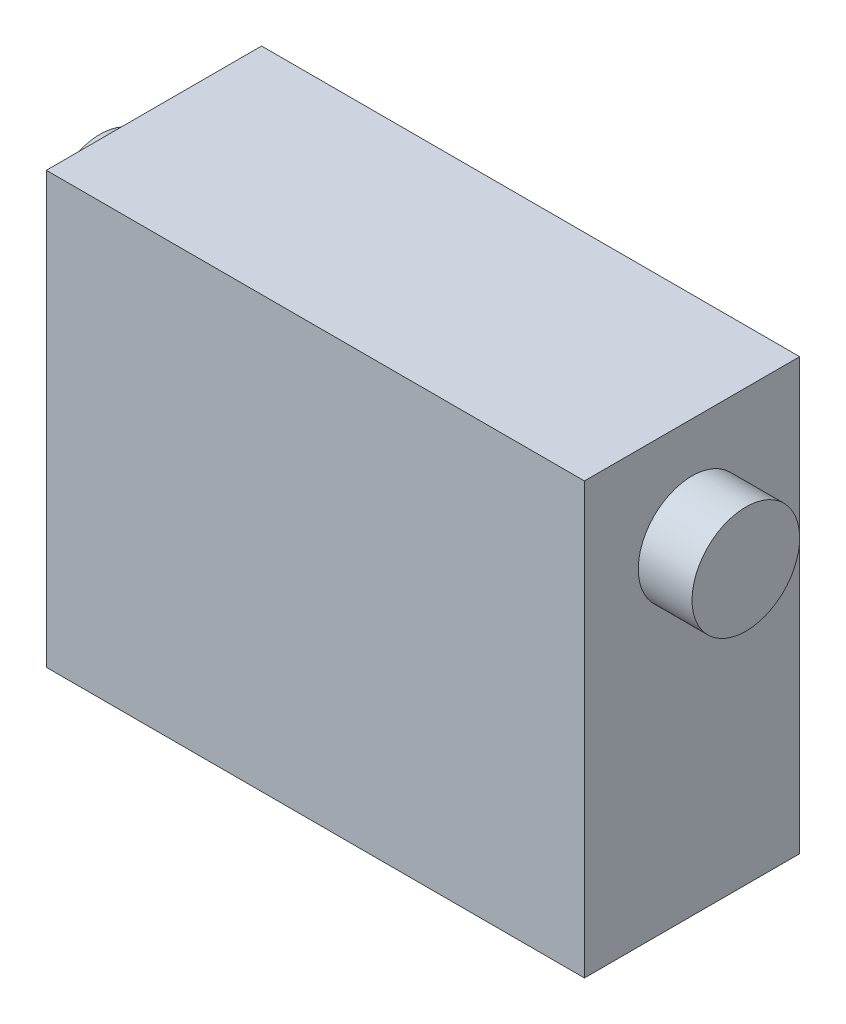
ISO-10303-21;
HEADER;
FILE_DESCRIPTION(('STEP AP214'),'2;1');
FILE_NAME('part.step','',(''),(''),'','','');
FILE_SCHEMA(('AUTOMOTIVE_DESIGN { 1 0 10303 214 1 1 1 1 }'));
ENDSEC;
DATA;
#1=APPLICATION_CONTEXT('core data for automotive mechanical design processes');
#2=APPLICATION_PROTOCOL_DEFINITION('international standard','automotive_design',2000,#1);
#3=PRODUCT_CONTEXT('',#1,'mechanical');
#4=PRODUCT('Part','Part','',(#3));
#5=PRODUCT_RELATED_PRODUCT_CATEGORY('part','',(#4));
#6=PRODUCT_DEFINITION_FORMATION('','',#4);
#7=PRODUCT_DEFINITION_CONTEXT('part definition',#1,'design');
#8=PRODUCT_DEFINITION('design','',#6,#7);
#9=PRODUCT_DEFINITION_SHAPE('','',#8);
#10=(LENGTH_UNIT() NAMED_UNIT(*) SI_UNIT(.MILLI.,.METRE.));
#11=(NAMED_UNIT(*) PLANE_ANGLE_UNIT() SI_UNIT($,.RADIAN.));
#12=(NAMED_UNIT(*) SI_UNIT($,.STERADIAN.) SOLID_ANGLE_UNIT());
#13=UNCERTAINTY_MEASURE_WITH_UNIT(LENGTH_MEASURE(1.E-05),#10,'distance_accuracy_value','');
#14=(GEOMETRIC_REPRESENTATION_CONTEXT(3) GLOBAL_UNCERTAINTY_ASSIGNED_CONTEXT((#13)) GLOBAL_UNIT_ASSIGNED_CONTEXT((#10,
#11,#12)) REPRESENTATION_CONTEXT('',''));
#15=CARTESIAN_POINT('',(0.,0.,0.));
#16=DIRECTION('',(0.,0.,1.));
#17=DIRECTION('',(1.,0.,0.));
#18=AXIS2_PLACEMENT_3D('',#15,#16,#17);
#19=CARTESIAN_POINT('',(25.,20.,20.));
#20=DIRECTION('',(-1.,0.,0.));
#21=DIRECTION('',(0.,-1.,0.));
#22=AXIS2_PLACEMENT_3D('',#19,#20,#21);
#23=PLANE('',#22);
#24=CARTESIAN_POINT('',(25.,10.4077471543818,10.));
#25=DIRECTION('',(-1.,0.,0.));
#26=DIRECTION('',(0.,-1.,0.));
#27=AXIS2_PLACEMENT_3D('',#24,#25,#26);
#28=CIRCLE('',#27,5.);
#29=CARTESIAN_POINT('',(25.,5.40774715438176,10.));
#30=VERTEX_POINT('',#29);
#31=EDGE_CURVE('E102',#30,#30,#28,.T.);
#32=ORIENTED_EDGE('',*,*,#31,.T.);
#33=EDGE_LOOP('',(#32));
#34=FACE_BOUND('',#33,.T.);
#35=DIRECTION('',(0.,1.,0.));
#36=VECTOR('',#35,1.);
#37=CARTESIAN_POINT('',(25.,20.,0.));
#38=LINE('',#37,#36);
#39=CARTESIAN_POINT('',(25.,-20.,0.));
#40=VERTEX_POINT('',#39);
#41=CARTESIAN_POINT('',(25.,20.,0.));
#42=VERTEX_POINT('',#41);
#43=EDGE_CURVE('E99',#40,#42,#38,.T.);
#44=ORIENTED_EDGE('',*,*,#43,.T.);
#45=DIRECTION('',(0.,0.,-1.));
#46=VECTOR('',#45,1.);
#47=CARTESIAN_POINT('',(25.,20.,20.));
#48=LINE('',#47,#46);
#49=CARTESIAN_POINT('',(25.,20.,20.));
#50=VERTEX_POINT('',#49);
#51=EDGE_CURVE('E11',#50,#42,#48,.T.);
#52=ORIENTED_EDGE('',*,*,#51,.F.);
#53=DIRECTION('',(0.,1.,0.));
#54=VECTOR('',#53,1.);
#55=CARTESIAN_POINT('',(25.,20.,20.));
#56=LINE('',#55,#54);
#57=CARTESIAN_POINT('',(25.,-20.,20.));
#58=VERTEX_POINT('',#57);
#59=EDGE_CURVE('E86',#58,#50,#56,.T.);
#60=ORIENTED_EDGE('',*,*,#59,.F.);
#61=DIRECTION('',(0.,0.,-1.));
#62=VECTOR('',#61,1.);
#63=CARTESIAN_POINT('',(25.,-20.,20.));
#64=LINE('',#63,#62);
#65=EDGE_CURVE('E95',#58,#40,#64,.T.);
#66=ORIENTED_EDGE('',*,*,#65,.T.);
#67=EDGE_LOOP('',(#44,#52,#60,#66));
#68=FACE_BOUND('',#67,.T.);
#69=ADVANCED_FACE('F34',(#34,#68),#23,.F.);
#70=CARTESIAN_POINT('',(-25.,20.,20.));
#71=DIRECTION('',(0.,-1.,0.));
#72=DIRECTION('',(0.,0.,-1.));
#73=AXIS2_PLACEMENT_3D('',#70,#71,#72);
#74=PLANE('',#73);
#75=DIRECTION('',(-1.,0.,0.));
#76=VECTOR('',#75,1.);
#77=CARTESIAN_POINT('',(-25.,20.,0.));
#78=LINE('',#77,#76);
#79=CARTESIAN_POINT('',(-25.,20.,0.));
#80=VERTEX_POINT('',#79);
#81=EDGE_CURVE('E90',#42,#80,#78,.T.);
#82=ORIENTED_EDGE('',*,*,#81,.T.);
#83=DIRECTION('',(0.,0.,-1.));
#84=VECTOR('',#83,1.);
#85=CARTESIAN_POINT('',(-25.,20.,20.));
#86=LINE('',#85,#84);
#87=CARTESIAN_POINT('',(-25.,20.,20.));
#88=VERTEX_POINT('',#87);
#89=EDGE_CURVE('E43',#88,#80,#86,.T.);
#90=ORIENTED_EDGE('',*,*,#89,.F.);
#91=DIRECTION('',(-1.,0.,0.));
#92=VECTOR('',#91,1.);
#93=CARTESIAN_POINT('',(-25.,20.,20.));
#94=LINE('',#93,#92);
#95=EDGE_CURVE('E81',#50,#88,#94,.T.);
#96=ORIENTED_EDGE('',*,*,#95,.F.);
#97=ORIENTED_EDGE('',*,*,#51,.T.);
#98=EDGE_LOOP('',(#82,#90,#96,#97));
#99=FACE_BOUND('',#98,.T.);
#100=ADVANCED_FACE('F89',(#99),#74,.F.);
#101=CARTESIAN_POINT('',(-25.,20.,20.));
#102=DIRECTION('',(1.,0.,0.));
#103=DIRECTION('',(0.,1.,0.));
#104=AXIS2_PLACEMENT_3D('',#101,#102,#103);
#105=PLANE('',#104);
#106=CARTESIAN_POINT('',(-25.,10.4077471543817,10.));
#107=DIRECTION('',(1.,0.,0.));
#108=DIRECTION('',(0.,1.,0.));
#109=AXIS2_PLACEMENT_3D('',#106,#107,#108);
#110=CIRCLE('',#109,5.);
#111=CARTESIAN_POINT('',(-25.,15.4077471543817,10.));
#112=VERTEX_POINT('',#111);
#113=EDGE_CURVE('E37',#112,#112,#110,.T.);
#114=ORIENTED_EDGE('',*,*,#113,.T.);
#115=EDGE_LOOP('',(#114));
#116=FACE_BOUND('',#115,.T.);
#117=DIRECTION('',(0.,-1.,0.));
#118=VECTOR('',#117,1.);
#119=CARTESIAN_POINT('',(-25.,20.,0.));
#120=LINE('',#119,#118);
#121=CARTESIAN_POINT('',(-25.,-20.,0.));
#122=VERTEX_POINT('',#121);
#123=EDGE_CURVE('E68',#80,#122,#120,.T.);
#124=ORIENTED_EDGE('',*,*,#123,.T.);
#125=DIRECTION('',(0.,0.,-1.));
#126=VECTOR('',#125,1.);
#127=CARTESIAN_POINT('',(-25.,-20.,20.));
#128=LINE('',#127,#126);
#129=CARTESIAN_POINT('',(-25.,-20.,20.));
#130=VERTEX_POINT('',#129);
#131=EDGE_CURVE('E91',#130,#122,#128,.T.);
#132=ORIENTED_EDGE('',*,*,#131,.F.);
#133=DIRECTION('',(0.,-1.,0.));
#134=VECTOR('',#133,1.);
#135=CARTESIAN_POINT('',(-25.,20.,20.));
#136=LINE('',#135,#134);
#137=EDGE_CURVE('E84',#88,#130,#136,.T.);
#138=ORIENTED_EDGE('',*,*,#137,.F.);
#139=ORIENTED_EDGE('',*,*,#89,.T.);
#140=EDGE_LOOP('',(#124,#132,#138,#139));
#141=FACE_BOUND('',#140,.T.);
#142=ADVANCED_FACE('F93',(#116,#141),#105,.F.);
#143=CARTESIAN_POINT('',(-25.,-20.,20.));
#144=DIRECTION('',(0.,1.,0.));
#145=DIRECTION('',(0.,0.,1.));
#146=AXIS2_PLACEMENT_3D('',#143,#144,#145);
#147=PLANE('',#146);
#148=DIRECTION('',(1.,0.,0.));
#149=VECTOR('',#148,1.);
#150=CARTESIAN_POINT('',(-25.,-20.,0.));
#151=LINE('',#150,#149);
#152=EDGE_CURVE('E74',#122,#40,#151,.T.);
#153=ORIENTED_EDGE('',*,*,#152,.T.);
#154=ORIENTED_EDGE('',*,*,#65,.F.);
#155=DIRECTION('',(1.,0.,0.));
#156=VECTOR('',#155,1.);
#157=CARTESIAN_POINT('',(-25.,-20.,20.));
#158=LINE('',#157,#156);
#159=EDGE_CURVE('E51',#130,#58,#158,.T.);
#160=ORIENTED_EDGE('',*,*,#159,.F.);
#161=ORIENTED_EDGE('',*,*,#131,.T.);
#162=EDGE_LOOP('',(#153,#154,#160,#161));
#163=FACE_BOUND('',#162,.T.);
#164=ADVANCED_FACE('F107',(#163),#147,.F.);
#165=CARTESIAN_POINT('',(0.,0.,20.));
#166=DIRECTION('',(0.,0.,1.));
#167=DIRECTION('',(1.,0.,0.));
#168=AXIS2_PLACEMENT_3D('',#165,#166,#167);
#169=PLANE('',#168);
#170=ORIENTED_EDGE('',*,*,#59,.T.);
#171=ORIENTED_EDGE('',*,*,#95,.T.);
#172=ORIENTED_EDGE('',*,*,#137,.T.);
#173=ORIENTED_EDGE('',*,*,#159,.T.);
#174=EDGE_LOOP('',(#170,#171,#172,#173));
#175=FACE_BOUND('',#174,.T.);
#176=ADVANCED_FACE('F82',(#175),#169,.T.);
#177=CARTESIAN_POINT('',(0.,0.,0.));
#178=DIRECTION('',(0.,0.,1.));
#179=DIRECTION('',(1.,0.,0.));
#180=AXIS2_PLACEMENT_3D('',#177,#178,#179);
#181=PLANE('',#180);
#182=ORIENTED_EDGE('',*,*,#43,.F.);
#183=ORIENTED_EDGE('',*,*,#152,.F.);
#184=ORIENTED_EDGE('',*,*,#123,.F.);
#185=ORIENTED_EDGE('',*,*,#81,.F.);
#186=EDGE_LOOP('',(#182,#183,#184,#185));
#187=FACE_BOUND('',#186,.T.);
#188=ADVANCED_FACE('F110',(#187),#181,.F.);
#189=CARTESIAN_POINT('',(-30.,10.4077471543817,10.));
#190=DIRECTION('',(-1.,0.,0.));
#191=DIRECTION('',(0.,-1.,0.));
#192=AXIS2_PLACEMENT_3D('',#189,#190,#191);
#193=PLANE('',#192);
#194=CARTESIAN_POINT('',(-30.,10.4077471543817,10.));
#195=DIRECTION('',(-1.,0.,0.));
#196=DIRECTION('',(0.,-1.,0.));
#197=AXIS2_PLACEMENT_3D('',#194,#195,#196);
#198=CIRCLE('',#197,5.);
#199=CARTESIAN_POINT('',(-30.,5.40774715438175,10.));
#200=VERTEX_POINT('',#199);
#201=EDGE_CURVE('E118',#200,#200,#198,.T.);
#202=ORIENTED_EDGE('',*,*,#201,.T.);
#203=EDGE_LOOP('',(#202));
#204=FACE_BOUND('',#203,.T.);
#205=ADVANCED_FACE('F122',(#204),#193,.T.);
#206=CARTESIAN_POINT('',(30.,10.4077471543818,10.));
#207=DIRECTION('',(-1.,0.,0.));
#208=DIRECTION('',(0.,-1.,0.));
#209=AXIS2_PLACEMENT_3D('',#206,#207,#208);
#210=CYLINDRICAL_SURFACE('',#209,5.);
#211=ORIENTED_EDGE('',*,*,#201,.F.);
#212=EDGE_LOOP('',(#211));
#213=FACE_BOUND('',#212,.T.);
#214=ORIENTED_EDGE('',*,*,#113,.F.);
#215=EDGE_LOOP('',(#214));
#216=FACE_BOUND('',#215,.T.);
#217=ADVANCED_FACE('F124',(#213,#216),#210,.T.);
#218=CARTESIAN_POINT('',(30.,10.4077471543818,10.));
#219=DIRECTION('',(-1.,0.,0.));
#220=DIRECTION('',(0.,-1.,0.));
#221=AXIS2_PLACEMENT_3D('',#218,#219,#220);
#222=CIRCLE('',#221,5.);
#223=CARTESIAN_POINT('',(30.,5.40774715438176,10.));
#224=VERTEX_POINT('',#223);
#225=EDGE_CURVE('E115',#224,#224,#222,.T.);
#226=ORIENTED_EDGE('',*,*,#225,.T.);
#227=EDGE_LOOP('',(#226));
#228=FACE_BOUND('',#227,.T.);
#229=ORIENTED_EDGE('',*,*,#31,.F.);
#230=EDGE_LOOP('',(#229));
#231=FACE_BOUND('',#230,.T.);
#232=ADVANCED_FACE('F127',(#228,#231),#210,.T.);
#233=CARTESIAN_POINT('',(30.,10.4077471543818,10.));
#234=DIRECTION('',(-1.,0.,0.));
#235=DIRECTION('',(0.,-1.,0.));
#236=AXIS2_PLACEMENT_3D('',#233,#234,#235);
#237=PLANE('',#236);
#238=ORIENTED_EDGE('',*,*,#225,.F.);
#239=EDGE_LOOP('',(#238));
#240=FACE_BOUND('',#239,.T.);
#241=ADVANCED_FACE('F146',(#240),#237,.F.);
#242=CLOSED_SHELL('',(#69,#100,#142,#164,#176,#188,#205,#217,#232,#241));
#243=MANIFOLD_SOLID_BREP('B2',#242);
#244=ADVANCED_BREP_SHAPE_REPRESENTATION('',(#18,#243),#14);
#245=SHAPE_DEFINITION_REPRESENTATION(#9,#244);
ENDSEC;
END-ISO-10303-21;
